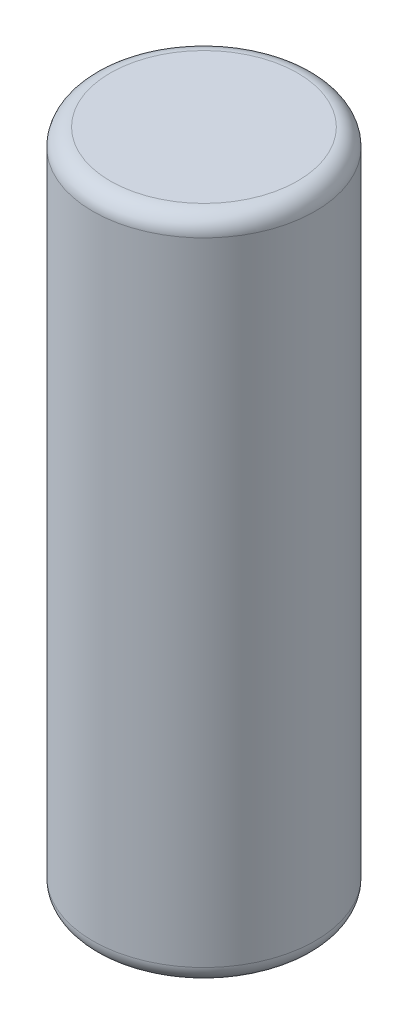
ISO-10303-21;
HEADER;
FILE_DESCRIPTION(('STEP AP214'),'2;1');
FILE_NAME('part.step','',(''),(''),'','','');
FILE_SCHEMA(('AUTOMOTIVE_DESIGN { 1 0 10303 214 1 1 1 1 }'));
ENDSEC;
DATA;
#1=APPLICATION_CONTEXT('core data for automotive mechanical design processes');
#2=APPLICATION_PROTOCOL_DEFINITION('international standard','automotive_design',2000,#1);
#3=PRODUCT_CONTEXT('',#1,'mechanical');
#4=PRODUCT('Part','Part','',(#3));
#5=PRODUCT_RELATED_PRODUCT_CATEGORY('part','',(#4));
#6=PRODUCT_DEFINITION_FORMATION('','',#4);
#7=PRODUCT_DEFINITION_CONTEXT('part definition',#1,'design');
#8=PRODUCT_DEFINITION('design','',#6,#7);
#9=PRODUCT_DEFINITION_SHAPE('','',#8);
#10=(LENGTH_UNIT() NAMED_UNIT(*) SI_UNIT(.MILLI.,.METRE.));
#11=(NAMED_UNIT(*) PLANE_ANGLE_UNIT() SI_UNIT($,.RADIAN.));
#12=(NAMED_UNIT(*) SI_UNIT($,.STERADIAN.) SOLID_ANGLE_UNIT());
#13=UNCERTAINTY_MEASURE_WITH_UNIT(LENGTH_MEASURE(1.E-05),#10,'distance_accuracy_value','');
#14=(GEOMETRIC_REPRESENTATION_CONTEXT(3) GLOBAL_UNCERTAINTY_ASSIGNED_CONTEXT((#13)) GLOBAL_UNIT_ASSIGNED_CONTEXT((#10,
#11,#12)) REPRESENTATION_CONTEXT('',''));
#15=CARTESIAN_POINT('',(0.,0.,0.));
#16=DIRECTION('',(0.,0.,1.));
#17=DIRECTION('',(1.,0.,0.));
#18=AXIS2_PLACEMENT_3D('',#15,#16,#17);
#19=CARTESIAN_POINT('',(0.,19.05,0.));
#20=DIRECTION('',(0.,-1.,0.));
#21=DIRECTION('',(0.,0.,-1.));
#22=AXIS2_PLACEMENT_3D('',#19,#20,#21);
#23=CYLINDRICAL_SURFACE('',#22,3.175);
#24=CARTESIAN_POINT('',(0.,0.5,0.));
#25=DIRECTION('',(0.,1.,0.));
#26=DIRECTION('',(0.,0.,1.));
#27=AXIS2_PLACEMENT_3D('',#24,#25,#26);
#28=CIRCLE('',#27,3.175);
#29=CARTESIAN_POINT('',(0.,0.5,3.175));
#30=VERTEX_POINT('',#29);
#31=EDGE_CURVE('E40',#30,#30,#28,.T.);
#32=ORIENTED_EDGE('',*,*,#31,.T.);
#33=EDGE_LOOP('',(#32));
#34=FACE_BOUND('',#33,.T.);
#35=CARTESIAN_POINT('',(0.,18.55,0.));
#36=DIRECTION('',(0.,1.,0.));
#37=DIRECTION('',(0.,0.,1.));
#38=AXIS2_PLACEMENT_3D('',#35,#36,#37);
#39=CIRCLE('',#38,3.175);
#40=CARTESIAN_POINT('',(0.,18.55,3.175));
#41=VERTEX_POINT('',#40);
#42=EDGE_CURVE('E44',#41,#41,#39,.F.);
#43=ORIENTED_EDGE('',*,*,#42,.T.);
#44=EDGE_LOOP('',(#43));
#45=FACE_BOUND('',#44,.T.);
#46=ADVANCED_FACE('F29',(#34,#45),#23,.T.);
#47=CARTESIAN_POINT('',(0.,19.05,0.));
#48=DIRECTION('',(0.,1.,0.));
#49=DIRECTION('',(0.,0.,1.));
#50=AXIS2_PLACEMENT_3D('',#47,#48,#49);
#51=PLANE('',#50);
#52=CARTESIAN_POINT('',(0.,19.05,0.));
#53=DIRECTION('',(0.,1.,0.));
#54=DIRECTION('',(0.,0.,1.));
#55=AXIS2_PLACEMENT_3D('',#52,#53,#54);
#56=CIRCLE('',#55,2.675);
#57=CARTESIAN_POINT('',(0.,19.05,2.675));
#58=VERTEX_POINT('',#57);
#59=EDGE_CURVE('E10',#58,#58,#56,.T.);
#60=ORIENTED_EDGE('',*,*,#59,.T.);
#61=EDGE_LOOP('',(#60));
#62=FACE_BOUND('',#61,.T.);
#63=ADVANCED_FACE('F60',(#62),#51,.T.);
#64=CARTESIAN_POINT('',(0.,0.,0.));
#65=DIRECTION('',(0.,1.,0.));
#66=DIRECTION('',(0.,0.,1.));
#67=AXIS2_PLACEMENT_3D('',#64,#65,#66);
#68=PLANE('',#67);
#69=CARTESIAN_POINT('',(0.,0.,0.));
#70=DIRECTION('',(0.,1.,0.));
#71=DIRECTION('',(0.,0.,1.));
#72=AXIS2_PLACEMENT_3D('',#69,#70,#71);
#73=CIRCLE('',#72,2.675);
#74=CARTESIAN_POINT('',(0.,0.,2.675));
#75=VERTEX_POINT('',#74);
#76=EDGE_CURVE('E36',#75,#75,#73,.F.);
#77=ORIENTED_EDGE('',*,*,#76,.T.);
#78=EDGE_LOOP('',(#77));
#79=FACE_BOUND('',#78,.T.);
#80=ADVANCED_FACE('F57',(#79),#68,.F.);
#81=CARTESIAN_POINT('',(0.,0.5,0.));
#82=DIRECTION('',(0.,1.,0.));
#83=DIRECTION('',(0.,0.,1.));
#84=AXIS2_PLACEMENT_3D('',#81,#82,#83);
#85=TOROIDAL_SURFACE('',#84,2.675,0.5);
#86=ORIENTED_EDGE('',*,*,#76,.F.);
#87=EDGE_LOOP('',(#86));
#88=FACE_BOUND('',#87,.T.);
#89=ORIENTED_EDGE('',*,*,#31,.F.);
#90=EDGE_LOOP('',(#89));
#91=FACE_BOUND('',#90,.T.);
#92=ADVANCED_FACE('F53',(#88,#91),#85,.T.);
#93=CARTESIAN_POINT('',(0.,18.55,0.));
#94=DIRECTION('',(0.,1.,0.));
#95=DIRECTION('',(0.,0.,1.));
#96=AXIS2_PLACEMENT_3D('',#93,#94,#95);
#97=TOROIDAL_SURFACE('',#96,2.675,0.5);
#98=ORIENTED_EDGE('',*,*,#42,.F.);
#99=EDGE_LOOP('',(#98));
#100=FACE_BOUND('',#99,.T.);
#101=ORIENTED_EDGE('',*,*,#59,.F.);
#102=EDGE_LOOP('',(#101));
#103=FACE_BOUND('',#102,.T.);
#104=ADVANCED_FACE('F31',(#100,#103),#97,.T.);
#105=CLOSED_SHELL('',(#46,#63,#80,#92,#104));
#106=MANIFOLD_SOLID_BREP('B2',#105);
#107=ADVANCED_BREP_SHAPE_REPRESENTATION('',(#18,#106),#14);
#108=SHAPE_DEFINITION_REPRESENTATION(#9,#107);
ENDSEC;
END-ISO-10303-21;
